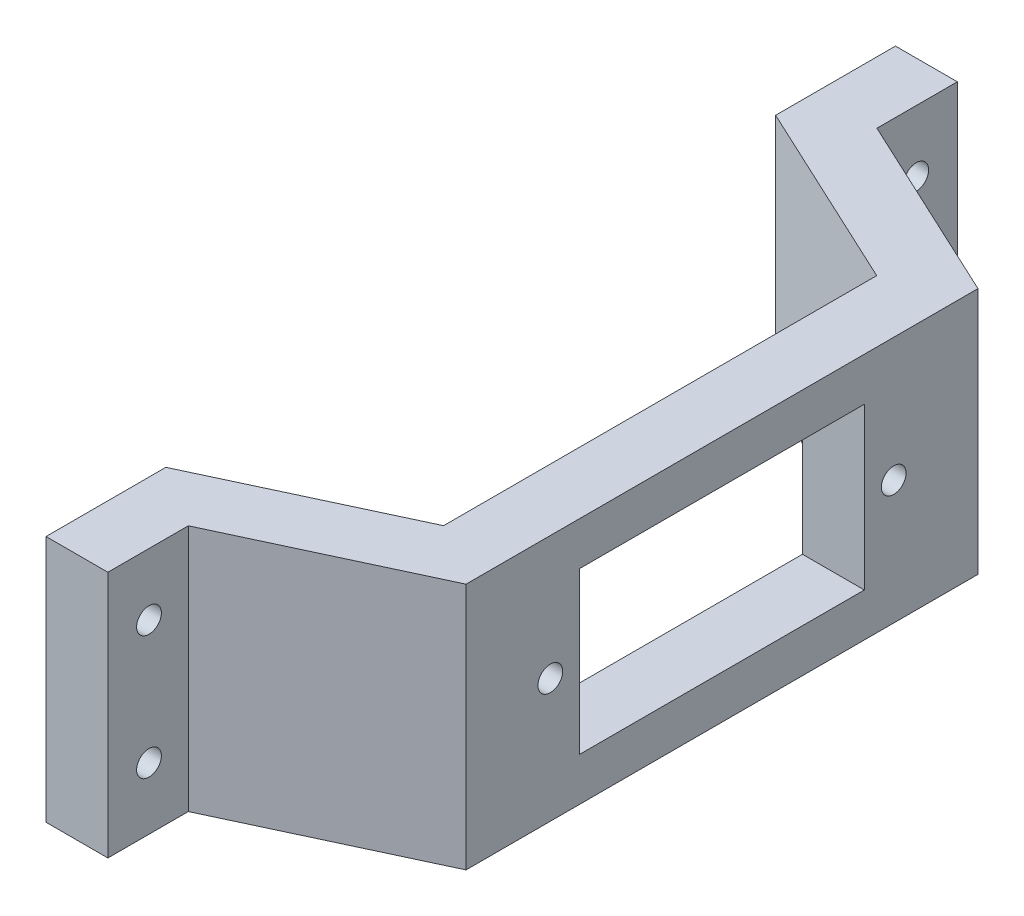
ISO-10303-21;
HEADER;
FILE_DESCRIPTION(('STEP AP214'),'2;1');
FILE_NAME('part.step','',(''),(''),'','','');
FILE_SCHEMA(('AUTOMOTIVE_DESIGN { 1 0 10303 214 1 1 1 1 }'));
ENDSEC;
DATA;
#1=APPLICATION_CONTEXT('core data for automotive mechanical design processes');
#2=APPLICATION_PROTOCOL_DEFINITION('international standard','automotive_design',2000,#1);
#3=PRODUCT_CONTEXT('',#1,'mechanical');
#4=PRODUCT('Part','Part','',(#3));
#5=PRODUCT_RELATED_PRODUCT_CATEGORY('part','',(#4));
#6=PRODUCT_DEFINITION_FORMATION('','',#4);
#7=PRODUCT_DEFINITION_CONTEXT('part definition',#1,'design');
#8=PRODUCT_DEFINITION('design','',#6,#7);
#9=PRODUCT_DEFINITION_SHAPE('','',#8);
#10=(LENGTH_UNIT() NAMED_UNIT(*) SI_UNIT(.MILLI.,.METRE.));
#11=(NAMED_UNIT(*) PLANE_ANGLE_UNIT() SI_UNIT($,.RADIAN.));
#12=(NAMED_UNIT(*) SI_UNIT($,.STERADIAN.) SOLID_ANGLE_UNIT());
#13=UNCERTAINTY_MEASURE_WITH_UNIT(LENGTH_MEASURE(1.E-05),#10,'distance_accuracy_value','');
#14=(GEOMETRIC_REPRESENTATION_CONTEXT(3) GLOBAL_UNCERTAINTY_ASSIGNED_CONTEXT((#13)) GLOBAL_UNIT_ASSIGNED_CONTEXT((#10,
#11,#12)) REPRESENTATION_CONTEXT('',''));
#15=CARTESIAN_POINT('',(0.,0.,0.));
#16=DIRECTION('',(0.,0.,1.));
#17=DIRECTION('',(1.,0.,0.));
#18=AXIS2_PLACEMENT_3D('',#15,#16,#17);
#19=CARTESIAN_POINT('',(5.,-10.,-34.3232158889476));
#20=DIRECTION('',(0.,0.,-1.));
#21=DIRECTION('',(-1.,0.,0.));
#22=AXIS2_PLACEMENT_3D('',#19,#20,#21);
#23=PLANE('',#22);
#24=DIRECTION('',(0.,1.,0.));
#25=VECTOR('',#24,1.);
#26=CARTESIAN_POINT('',(0.,-10.,-34.3232158889476));
#27=LINE('',#26,#25);
#28=CARTESIAN_POINT('',(0.,-10.,-34.3232158889476));
#29=VERTEX_POINT('',#28);
#30=CARTESIAN_POINT('',(0.,10.,-34.3232158889476));
#31=VERTEX_POINT('',#30);
#32=EDGE_CURVE('E42',#29,#31,#27,.T.);
#33=ORIENTED_EDGE('',*,*,#32,.T.);
#34=DIRECTION('',(-1.,0.,0.));
#35=VECTOR('',#34,1.);
#36=CARTESIAN_POINT('',(5.,10.,-34.3232158889476));
#37=LINE('',#36,#35);
#38=CARTESIAN_POINT('',(5.,10.,-34.3232158889476));
#39=VERTEX_POINT('',#38);
#40=EDGE_CURVE('E205',#39,#31,#37,.T.);
#41=ORIENTED_EDGE('',*,*,#40,.F.);
#42=DIRECTION('',(0.,1.,0.));
#43=VECTOR('',#42,1.);
#44=CARTESIAN_POINT('',(5.,-10.,-34.3232158889476));
#45=LINE('',#44,#43);
#46=CARTESIAN_POINT('',(5.,-10.,-34.3232158889476));
#47=VERTEX_POINT('',#46);
#48=EDGE_CURVE('E11',#47,#39,#45,.T.);
#49=ORIENTED_EDGE('',*,*,#48,.F.);
#50=DIRECTION('',(-1.,0.,0.));
#51=VECTOR('',#50,1.);
#52=CARTESIAN_POINT('',(5.,-10.,-34.3232158889476));
#53=LINE('',#52,#51);
#54=EDGE_CURVE('E254',#47,#29,#53,.T.);
#55=ORIENTED_EDGE('',*,*,#54,.T.);
#56=EDGE_LOOP('',(#33,#41,#49,#55));
#57=FACE_BOUND('',#56,.T.);
#58=ADVANCED_FACE('F39',(#57),#23,.T.);
#59=CARTESIAN_POINT('',(5.,-10.,-27.8232158889476));
#60=DIRECTION('',(1.,0.,0.));
#61=DIRECTION('',(0.,0.,-1.));
#62=AXIS2_PLACEMENT_3D('',#59,#60,#61);
#63=PLANE('',#62);
#64=CARTESIAN_POINT('',(5.,5.,-31.));
#65=DIRECTION('',(1.,0.,0.));
#66=DIRECTION('',(0.,0.,1.));
#67=AXIS2_PLACEMENT_3D('',#64,#65,#66);
#68=CIRCLE('',#67,0.999999999999998);
#69=CARTESIAN_POINT('',(5.,5.,-30.));
#70=VERTEX_POINT('',#69);
#71=EDGE_CURVE('E636',#70,#70,#68,.T.);
#72=ORIENTED_EDGE('',*,*,#71,.F.);
#73=EDGE_LOOP('',(#72));
#74=FACE_BOUND('',#73,.T.);
#75=CARTESIAN_POINT('',(5.,-4.99999999999999,-31.));
#76=DIRECTION('',(1.,0.,0.));
#77=DIRECTION('',(0.,0.,-1.));
#78=AXIS2_PLACEMENT_3D('',#75,#76,#77);
#79=CIRCLE('',#78,0.999999999999998);
#80=CARTESIAN_POINT('',(5.,-4.99999999999999,-32.));
#81=VERTEX_POINT('',#80);
#82=EDGE_CURVE('E612',#81,#81,#79,.T.);
#83=ORIENTED_EDGE('',*,*,#82,.F.);
#84=EDGE_LOOP('',(#83));
#85=FACE_BOUND('',#84,.T.);
#86=ORIENTED_EDGE('',*,*,#48,.T.);
#87=DIRECTION('',(0.,0.,-1.));
#88=VECTOR('',#87,1.);
#89=CARTESIAN_POINT('',(5.,10.,-27.8232158889476));
#90=LINE('',#89,#88);
#91=CARTESIAN_POINT('',(5.,10.,-27.8232158889476));
#92=VERTEX_POINT('',#91);
#93=EDGE_CURVE('E250',#92,#39,#90,.T.);
#94=ORIENTED_EDGE('',*,*,#93,.F.);
#95=DIRECTION('',(0.,1.,0.));
#96=VECTOR('',#95,1.);
#97=CARTESIAN_POINT('',(5.,-10.,-27.8232158889476));
#98=LINE('',#97,#96);
#99=CARTESIAN_POINT('',(5.,-10.,-27.8232158889476));
#100=VERTEX_POINT('',#99);
#101=EDGE_CURVE('E48',#100,#92,#98,.T.);
#102=ORIENTED_EDGE('',*,*,#101,.F.);
#103=DIRECTION('',(0.,0.,-1.));
#104=VECTOR('',#103,1.);
#105=CARTESIAN_POINT('',(5.,-10.,-27.8232158889476));
#106=LINE('',#105,#104);
#107=EDGE_CURVE('E298',#100,#47,#106,.T.);
#108=ORIENTED_EDGE('',*,*,#107,.T.);
#109=EDGE_LOOP('',(#86,#94,#102,#108));
#110=FACE_BOUND('',#109,.T.);
#111=ADVANCED_FACE('F343',(#74,#85,#110),#63,.T.);
#112=CARTESIAN_POINT('',(20.3072,-10.,-20.6853513040375));
#113=DIRECTION('',(0.422618261740697,0.,-0.906307787036651));
#114=DIRECTION('',(-0.906307787036651,0.,-0.422618261740697));
#115=AXIS2_PLACEMENT_3D('',#112,#113,#114);
#116=PLANE('',#115);
#117=ORIENTED_EDGE('',*,*,#101,.T.);
#118=DIRECTION('',(-0.906307787036651,0.,-0.422618261740697));
#119=VECTOR('',#118,1.);
#120=CARTESIAN_POINT('',(20.3072,10.,-20.6853513040375));
#121=LINE('',#120,#119);
#122=CARTESIAN_POINT('',(20.3072,10.,-20.6853513040375));
#123=VERTEX_POINT('',#122);
#124=EDGE_CURVE('E246',#123,#92,#121,.T.);
#125=ORIENTED_EDGE('',*,*,#124,.F.);
#126=DIRECTION('',(0.,1.,0.));
#127=VECTOR('',#126,1.);
#128=CARTESIAN_POINT('',(20.3072,-10.,-20.6853513040375));
#129=LINE('',#128,#127);
#130=CARTESIAN_POINT('',(20.3072,-10.,-20.6853513040375));
#131=VERTEX_POINT('',#130);
#132=EDGE_CURVE('E304',#131,#123,#129,.T.);
#133=ORIENTED_EDGE('',*,*,#132,.F.);
#134=DIRECTION('',(-0.906307787036651,0.,-0.422618261740697));
#135=VECTOR('',#134,1.);
#136=CARTESIAN_POINT('',(20.3072,-10.,-20.6853513040375));
#137=LINE('',#136,#135);
#138=EDGE_CURVE('E294',#131,#100,#137,.T.);
#139=ORIENTED_EDGE('',*,*,#138,.T.);
#140=EDGE_LOOP('',(#117,#125,#133,#139));
#141=FACE_BOUND('',#140,.T.);
#142=ADVANCED_FACE('F378',(#141),#116,.T.);
#143=CARTESIAN_POINT('',(20.3072,-10.,20.6853513040375));
#144=DIRECTION('',(1.,0.,0.));
#145=DIRECTION('',(0.,0.,-1.));
#146=AXIS2_PLACEMENT_3D('',#143,#144,#145);
#147=PLANE('',#146);
#148=CARTESIAN_POINT('',(20.3072,0.,-13.875));
#149=DIRECTION('',(-1.,0.,0.));
#150=DIRECTION('',(0.,0.,1.));
#151=AXIS2_PLACEMENT_3D('',#148,#149,#150);
#152=CIRCLE('',#151,1.);
#153=CARTESIAN_POINT('',(20.3072,0.,-12.875));
#154=VERTEX_POINT('',#153);
#155=EDGE_CURVE('E210',#154,#154,#152,.T.);
#156=ORIENTED_EDGE('',*,*,#155,.T.);
#157=EDGE_LOOP('',(#156));
#158=FACE_BOUND('',#157,.T.);
#159=CARTESIAN_POINT('',(20.3072,0.,13.875));
#160=DIRECTION('',(-1.,0.,0.));
#161=DIRECTION('',(0.,0.,1.));
#162=AXIS2_PLACEMENT_3D('',#159,#160,#161);
#163=CIRCLE('',#162,1.);
#164=CARTESIAN_POINT('',(20.3072,0.,14.875));
#165=VERTEX_POINT('',#164);
#166=EDGE_CURVE('E601',#165,#165,#163,.T.);
#167=ORIENTED_EDGE('',*,*,#166,.T.);
#168=EDGE_LOOP('',(#167));
#169=FACE_BOUND('',#168,.T.);
#170=DIRECTION('',(0.,-1.,0.));
#171=VECTOR('',#170,1.);
#172=CARTESIAN_POINT('',(20.3072,6.5,-11.5));
#173=LINE('',#172,#171);
#174=CARTESIAN_POINT('',(20.3072,6.5,-11.5));
#175=VERTEX_POINT('',#174);
#176=CARTESIAN_POINT('',(20.3072,-6.5,-11.5));
#177=VERTEX_POINT('',#176);
#178=EDGE_CURVE('E155',#175,#177,#173,.T.);
#179=ORIENTED_EDGE('',*,*,#178,.T.);
#180=DIRECTION('',(0.,0.,1.));
#181=VECTOR('',#180,1.);
#182=CARTESIAN_POINT('',(20.3072,-6.5,11.5));
#183=LINE('',#182,#181);
#184=CARTESIAN_POINT('',(20.3072,-6.5,11.5));
#185=VERTEX_POINT('',#184);
#186=EDGE_CURVE('E165',#177,#185,#183,.T.);
#187=ORIENTED_EDGE('',*,*,#186,.T.);
#188=DIRECTION('',(0.,1.,0.));
#189=VECTOR('',#188,1.);
#190=CARTESIAN_POINT('',(20.3072,6.5,11.5));
#191=LINE('',#190,#189);
#192=CARTESIAN_POINT('',(20.3072,6.5,11.5));
#193=VERTEX_POINT('',#192);
#194=EDGE_CURVE('E56',#185,#193,#191,.T.);
#195=ORIENTED_EDGE('',*,*,#194,.T.);
#196=DIRECTION('',(0.,0.,-1.));
#197=VECTOR('',#196,1.);
#198=CARTESIAN_POINT('',(20.3072,6.5,11.5));
#199=LINE('',#198,#197);
#200=EDGE_CURVE('E162',#193,#175,#199,.T.);
#201=ORIENTED_EDGE('',*,*,#200,.T.);
#202=EDGE_LOOP('',(#179,#187,#195,#201));
#203=FACE_BOUND('',#202,.T.);
#204=ORIENTED_EDGE('',*,*,#132,.T.);
#205=DIRECTION('',(0.,0.,-1.));
#206=VECTOR('',#205,1.);
#207=CARTESIAN_POINT('',(20.3072,10.,20.6853513040375));
#208=LINE('',#207,#206);
#209=CARTESIAN_POINT('',(20.3072,10.,20.6853513040375));
#210=VERTEX_POINT('',#209);
#211=EDGE_CURVE('E242',#210,#123,#208,.T.);
#212=ORIENTED_EDGE('',*,*,#211,.F.);
#213=DIRECTION('',(0.,1.,0.));
#214=VECTOR('',#213,1.);
#215=CARTESIAN_POINT('',(20.3072,-10.,20.6853513040375));
#216=LINE('',#215,#214);
#217=CARTESIAN_POINT('',(20.3072,-10.,20.6853513040375));
#218=VERTEX_POINT('',#217);
#219=EDGE_CURVE('E307',#218,#210,#216,.T.);
#220=ORIENTED_EDGE('',*,*,#219,.F.);
#221=DIRECTION('',(0.,0.,-1.));
#222=VECTOR('',#221,1.);
#223=CARTESIAN_POINT('',(20.3072,-10.,20.6853513040375));
#224=LINE('',#223,#222);
#225=EDGE_CURVE('E290',#218,#131,#224,.T.);
#226=ORIENTED_EDGE('',*,*,#225,.T.);
#227=EDGE_LOOP('',(#204,#212,#220,#226));
#228=FACE_BOUND('',#227,.T.);
#229=ADVANCED_FACE('F170',(#158,#169,#203,#228),#147,.T.);
#230=CARTESIAN_POINT('',(5.,-10.,27.8232158889476));
#231=DIRECTION('',(0.422618261740697,0.,0.906307787036651));
#232=DIRECTION('',(0.906307787036651,0.,-0.422618261740697));
#233=AXIS2_PLACEMENT_3D('',#230,#231,#232);
#234=PLANE('',#233);
#235=ORIENTED_EDGE('',*,*,#219,.T.);
#236=DIRECTION('',(0.906307787036651,0.,-0.422618261740697));
#237=VECTOR('',#236,1.);
#238=CARTESIAN_POINT('',(5.,10.,27.8232158889476));
#239=LINE('',#238,#237);
#240=CARTESIAN_POINT('',(5.,10.,27.8232158889476));
#241=VERTEX_POINT('',#240);
#242=EDGE_CURVE('E238',#241,#210,#239,.T.);
#243=ORIENTED_EDGE('',*,*,#242,.F.);
#244=DIRECTION('',(0.,1.,0.));
#245=VECTOR('',#244,1.);
#246=CARTESIAN_POINT('',(5.,-10.,27.8232158889476));
#247=LINE('',#246,#245);
#248=CARTESIAN_POINT('',(5.,-10.,27.8232158889476));
#249=VERTEX_POINT('',#248);
#250=EDGE_CURVE('E310',#249,#241,#247,.T.);
#251=ORIENTED_EDGE('',*,*,#250,.F.);
#252=DIRECTION('',(0.906307787036651,0.,-0.422618261740697));
#253=VECTOR('',#252,1.);
#254=CARTESIAN_POINT('',(5.,-10.,27.8232158889476));
#255=LINE('',#254,#253);
#256=EDGE_CURVE('E286',#249,#218,#255,.T.);
#257=ORIENTED_EDGE('',*,*,#256,.T.);
#258=EDGE_LOOP('',(#235,#243,#251,#257));
#259=FACE_BOUND('',#258,.T.);
#260=ADVANCED_FACE('F374',(#259),#234,.T.);
#261=CARTESIAN_POINT('',(5.,-10.,34.3232158889476));
#262=DIRECTION('',(1.,0.,0.));
#263=DIRECTION('',(0.,0.,-1.));
#264=AXIS2_PLACEMENT_3D('',#261,#262,#263);
#265=PLANE('',#264);
#266=CARTESIAN_POINT('',(5.00000000000002,-5.,31.));
#267=DIRECTION('',(1.,0.,0.));
#268=DIRECTION('',(0.,0.,1.));
#269=AXIS2_PLACEMENT_3D('',#266,#267,#268);
#270=CIRCLE('',#269,0.999999999999998);
#271=CARTESIAN_POINT('',(5.00000000000002,-5.,32.));
#272=VERTEX_POINT('',#271);
#273=EDGE_CURVE('E620',#272,#272,#270,.T.);
#274=ORIENTED_EDGE('',*,*,#273,.F.);
#275=EDGE_LOOP('',(#274));
#276=FACE_BOUND('',#275,.T.);
#277=CARTESIAN_POINT('',(5.00000000000002,4.99999999999999,31.));
#278=DIRECTION('',(1.,0.,0.));
#279=DIRECTION('',(0.,0.,-1.));
#280=AXIS2_PLACEMENT_3D('',#277,#278,#279);
#281=CIRCLE('',#280,0.999999999999998);
#282=CARTESIAN_POINT('',(5.00000000000002,4.99999999999999,30.));
#283=VERTEX_POINT('',#282);
#284=EDGE_CURVE('E628',#283,#283,#281,.T.);
#285=ORIENTED_EDGE('',*,*,#284,.F.);
#286=EDGE_LOOP('',(#285));
#287=FACE_BOUND('',#286,.T.);
#288=ORIENTED_EDGE('',*,*,#250,.T.);
#289=DIRECTION('',(0.,0.,-1.));
#290=VECTOR('',#289,1.);
#291=CARTESIAN_POINT('',(5.,10.,34.3232158889476));
#292=LINE('',#291,#290);
#293=CARTESIAN_POINT('',(5.,10.,34.3232158889476));
#294=VERTEX_POINT('',#293);
#295=EDGE_CURVE('E234',#294,#241,#292,.T.);
#296=ORIENTED_EDGE('',*,*,#295,.F.);
#297=DIRECTION('',(0.,1.,0.));
#298=VECTOR('',#297,1.);
#299=CARTESIAN_POINT('',(5.,-10.,34.3232158889476));
#300=LINE('',#299,#298);
#301=CARTESIAN_POINT('',(5.,-10.,34.3232158889476));
#302=VERTEX_POINT('',#301);
#303=EDGE_CURVE('E313',#302,#294,#300,.T.);
#304=ORIENTED_EDGE('',*,*,#303,.F.);
#305=DIRECTION('',(0.,0.,-1.));
#306=VECTOR('',#305,1.);
#307=CARTESIAN_POINT('',(5.,-10.,34.3232158889476));
#308=LINE('',#307,#306);
#309=EDGE_CURVE('E282',#302,#249,#308,.T.);
#310=ORIENTED_EDGE('',*,*,#309,.T.);
#311=EDGE_LOOP('',(#288,#296,#304,#310));
#312=FACE_BOUND('',#311,.T.);
#313=ADVANCED_FACE('F370',(#276,#287,#312),#265,.T.);
#314=CARTESIAN_POINT('',(0.,-10.,34.3232158889476));
#315=DIRECTION('',(0.,0.,1.));
#316=DIRECTION('',(1.,0.,0.));
#317=AXIS2_PLACEMENT_3D('',#314,#315,#316);
#318=PLANE('',#317);
#319=ORIENTED_EDGE('',*,*,#303,.T.);
#320=DIRECTION('',(1.,0.,0.));
#321=VECTOR('',#320,1.);
#322=CARTESIAN_POINT('',(0.,10.,34.3232158889476));
#323=LINE('',#322,#321);
#324=CARTESIAN_POINT('',(0.,10.,34.3232158889476));
#325=VERTEX_POINT('',#324);
#326=EDGE_CURVE('E230',#325,#294,#323,.T.);
#327=ORIENTED_EDGE('',*,*,#326,.F.);
#328=DIRECTION('',(0.,1.,0.));
#329=VECTOR('',#328,1.);
#330=CARTESIAN_POINT('',(0.,-10.,34.3232158889476));
#331=LINE('',#330,#329);
#332=CARTESIAN_POINT('',(0.,-10.,34.3232158889476));
#333=VERTEX_POINT('',#332);
#334=EDGE_CURVE('E316',#333,#325,#331,.T.);
#335=ORIENTED_EDGE('',*,*,#334,.F.);
#336=DIRECTION('',(1.,0.,0.));
#337=VECTOR('',#336,1.);
#338=CARTESIAN_POINT('',(0.,-10.,34.3232158889476));
#339=LINE('',#338,#337);
#340=EDGE_CURVE('E278',#333,#302,#339,.T.);
#341=ORIENTED_EDGE('',*,*,#340,.T.);
#342=EDGE_LOOP('',(#319,#327,#335,#341));
#343=FACE_BOUND('',#342,.T.);
#344=ADVANCED_FACE('F368',(#343),#318,.T.);
#345=CARTESIAN_POINT('',(0.,-10.,24.6378645849102));
#346=DIRECTION('',(-1.,0.,0.));
#347=DIRECTION('',(0.,0.,1.));
#348=AXIS2_PLACEMENT_3D('',#345,#346,#347);
#349=PLANE('',#348);
#350=CARTESIAN_POINT('',(0.,-5.,31.));
#351=DIRECTION('',(1.,0.,0.));
#352=DIRECTION('',(0.,0.,1.));
#353=AXIS2_PLACEMENT_3D('',#350,#351,#352);
#354=CIRCLE('',#353,0.999999999999998);
#355=CARTESIAN_POINT('',(0.,-5.,32.));
#356=VERTEX_POINT('',#355);
#357=EDGE_CURVE('E624',#356,#356,#354,.T.);
#358=ORIENTED_EDGE('',*,*,#357,.T.);
#359=EDGE_LOOP('',(#358));
#360=FACE_BOUND('',#359,.T.);
#361=CARTESIAN_POINT('',(0.,4.99999999999999,31.));
#362=DIRECTION('',(1.,0.,0.));
#363=DIRECTION('',(0.,0.,-1.));
#364=AXIS2_PLACEMENT_3D('',#361,#362,#363);
#365=CIRCLE('',#364,0.999999999999998);
#366=CARTESIAN_POINT('',(0.,4.99999999999999,30.));
#367=VERTEX_POINT('',#366);
#368=EDGE_CURVE('E632',#367,#367,#365,.T.);
#369=ORIENTED_EDGE('',*,*,#368,.T.);
#370=EDGE_LOOP('',(#369));
#371=FACE_BOUND('',#370,.T.);
#372=ORIENTED_EDGE('',*,*,#334,.T.);
#373=DIRECTION('',(0.,0.,1.));
#374=VECTOR('',#373,1.);
#375=CARTESIAN_POINT('',(0.,10.,24.6378645849102));
#376=LINE('',#375,#374);
#377=CARTESIAN_POINT('',(0.,10.,24.6378645849102));
#378=VERTEX_POINT('',#377);
#379=EDGE_CURVE('E226',#378,#325,#376,.T.);
#380=ORIENTED_EDGE('',*,*,#379,.F.);
#381=DIRECTION('',(0.,1.,0.));
#382=VECTOR('',#381,1.);
#383=CARTESIAN_POINT('',(0.,-10.,24.6378645849102));
#384=LINE('',#383,#382);
#385=CARTESIAN_POINT('',(0.,-10.,24.6378645849102));
#386=VERTEX_POINT('',#385);
#387=EDGE_CURVE('E319',#386,#378,#384,.T.);
#388=ORIENTED_EDGE('',*,*,#387,.F.);
#389=DIRECTION('',(0.,0.,1.));
#390=VECTOR('',#389,1.);
#391=CARTESIAN_POINT('',(0.,-10.,24.6378645849102));
#392=LINE('',#391,#390);
#393=EDGE_CURVE('E274',#386,#333,#392,.T.);
#394=ORIENTED_EDGE('',*,*,#393,.T.);
#395=EDGE_LOOP('',(#372,#380,#388,#394));
#396=FACE_BOUND('',#395,.T.);
#397=ADVANCED_FACE('F363',(#360,#371,#396),#349,.T.);
#398=CARTESIAN_POINT('',(15.3072,-10.,17.5));
#399=DIRECTION('',(-0.422618261740697,0.,-0.906307787036651));
#400=DIRECTION('',(-0.906307787036651,0.,0.422618261740697));
#401=AXIS2_PLACEMENT_3D('',#398,#399,#400);
#402=PLANE('',#401);
#403=ORIENTED_EDGE('',*,*,#387,.T.);
#404=DIRECTION('',(-0.906307787036651,0.,0.422618261740697));
#405=VECTOR('',#404,1.);
#406=CARTESIAN_POINT('',(15.3072,10.,17.5));
#407=LINE('',#406,#405);
#408=CARTESIAN_POINT('',(15.3072,10.,17.5));
#409=VERTEX_POINT('',#408);
#410=EDGE_CURVE('E222',#409,#378,#407,.T.);
#411=ORIENTED_EDGE('',*,*,#410,.F.);
#412=DIRECTION('',(0.,1.,0.));
#413=VECTOR('',#412,1.);
#414=CARTESIAN_POINT('',(15.3072,-10.,17.5));
#415=LINE('',#414,#413);
#416=CARTESIAN_POINT('',(15.3072,-10.,17.5));
#417=VERTEX_POINT('',#416);
#418=EDGE_CURVE('E322',#417,#409,#415,.T.);
#419=ORIENTED_EDGE('',*,*,#418,.F.);
#420=DIRECTION('',(-0.906307787036651,0.,0.422618261740697));
#421=VECTOR('',#420,1.);
#422=CARTESIAN_POINT('',(15.3072,-10.,17.5));
#423=LINE('',#422,#421);
#424=EDGE_CURVE('E270',#417,#386,#423,.T.);
#425=ORIENTED_EDGE('',*,*,#424,.T.);
#426=EDGE_LOOP('',(#403,#411,#419,#425));
#427=FACE_BOUND('',#426,.T.);
#428=ADVANCED_FACE('F358',(#427),#402,.T.);
#429=CARTESIAN_POINT('',(15.3072,-10.,-17.5));
#430=DIRECTION('',(-1.,0.,0.));
#431=DIRECTION('',(0.,0.,1.));
#432=AXIS2_PLACEMENT_3D('',#429,#430,#431);
#433=PLANE('',#432);
#434=CARTESIAN_POINT('',(15.3072,0.,-13.875));
#435=DIRECTION('',(-1.,0.,0.));
#436=DIRECTION('',(0.,0.,1.));
#437=AXIS2_PLACEMENT_3D('',#434,#435,#436);
#438=CIRCLE('',#437,1.);
#439=CARTESIAN_POINT('',(15.3072,0.,-12.875));
#440=VERTEX_POINT('',#439);
#441=EDGE_CURVE('E593',#440,#440,#438,.T.);
#442=ORIENTED_EDGE('',*,*,#441,.F.);
#443=EDGE_LOOP('',(#442));
#444=FACE_BOUND('',#443,.T.);
#445=CARTESIAN_POINT('',(15.3072,0.,13.875));
#446=DIRECTION('',(-1.,0.,0.));
#447=DIRECTION('',(0.,0.,1.));
#448=AXIS2_PLACEMENT_3D('',#445,#446,#447);
#449=CIRCLE('',#448,1.);
#450=CARTESIAN_POINT('',(15.3072,0.,14.875));
#451=VERTEX_POINT('',#450);
#452=EDGE_CURVE('E181',#451,#451,#449,.T.);
#453=ORIENTED_EDGE('',*,*,#452,.F.);
#454=EDGE_LOOP('',(#453));
#455=FACE_BOUND('',#454,.T.);
#456=DIRECTION('',(0.,-1.,0.));
#457=VECTOR('',#456,1.);
#458=CARTESIAN_POINT('',(15.3072,6.5,-11.5));
#459=LINE('',#458,#457);
#460=CARTESIAN_POINT('',(15.3072,6.5,-11.5));
#461=VERTEX_POINT('',#460);
#462=CARTESIAN_POINT('',(15.3072,-6.5,-11.5));
#463=VERTEX_POINT('',#462);
#464=EDGE_CURVE('E64',#461,#463,#459,.T.);
#465=ORIENTED_EDGE('',*,*,#464,.F.);
#466=DIRECTION('',(0.,0.,-1.));
#467=VECTOR('',#466,1.);
#468=CARTESIAN_POINT('',(15.3072,6.5,11.5));
#469=LINE('',#468,#467);
#470=CARTESIAN_POINT('',(15.3072,6.5,11.5));
#471=VERTEX_POINT('',#470);
#472=EDGE_CURVE('E174',#471,#461,#469,.T.);
#473=ORIENTED_EDGE('',*,*,#472,.F.);
#474=DIRECTION('',(0.,1.,0.));
#475=VECTOR('',#474,1.);
#476=CARTESIAN_POINT('',(15.3072,6.5,11.5));
#477=LINE('',#476,#475);
#478=CARTESIAN_POINT('',(15.3072,-6.5,11.5));
#479=VERTEX_POINT('',#478);
#480=EDGE_CURVE('E178',#479,#471,#477,.T.);
#481=ORIENTED_EDGE('',*,*,#480,.F.);
#482=DIRECTION('',(0.,0.,1.));
#483=VECTOR('',#482,1.);
#484=CARTESIAN_POINT('',(15.3072,-6.5,11.5));
#485=LINE('',#484,#483);
#486=EDGE_CURVE('E190',#463,#479,#485,.T.);
#487=ORIENTED_EDGE('',*,*,#486,.F.);
#488=EDGE_LOOP('',(#465,#473,#481,#487));
#489=FACE_BOUND('',#488,.T.);
#490=ORIENTED_EDGE('',*,*,#418,.T.);
#491=DIRECTION('',(0.,0.,1.));
#492=VECTOR('',#491,1.);
#493=CARTESIAN_POINT('',(15.3072,10.,-17.5));
#494=LINE('',#493,#492);
#495=CARTESIAN_POINT('',(15.3072,10.,-17.5));
#496=VERTEX_POINT('',#495);
#497=EDGE_CURVE('E218',#496,#409,#494,.T.);
#498=ORIENTED_EDGE('',*,*,#497,.F.);
#499=DIRECTION('',(0.,1.,0.));
#500=VECTOR('',#499,1.);
#501=CARTESIAN_POINT('',(15.3072,-10.,-17.5));
#502=LINE('',#501,#500);
#503=CARTESIAN_POINT('',(15.3072,-10.,-17.5));
#504=VERTEX_POINT('',#503);
#505=EDGE_CURVE('E325',#504,#496,#502,.T.);
#506=ORIENTED_EDGE('',*,*,#505,.F.);
#507=DIRECTION('',(0.,0.,1.));
#508=VECTOR('',#507,1.);
#509=CARTESIAN_POINT('',(15.3072,-10.,-17.5));
#510=LINE('',#509,#508);
#511=EDGE_CURVE('E266',#504,#417,#510,.T.);
#512=ORIENTED_EDGE('',*,*,#511,.T.);
#513=EDGE_LOOP('',(#490,#498,#506,#512));
#514=FACE_BOUND('',#513,.T.);
#515=ADVANCED_FACE('F356',(#444,#455,#489,#514),#433,.T.);
#516=CARTESIAN_POINT('',(0.,-10.,-24.6378645849102));
#517=DIRECTION('',(-0.422618261740697,0.,0.906307787036651));
#518=DIRECTION('',(0.906307787036651,0.,0.422618261740697));
#519=AXIS2_PLACEMENT_3D('',#516,#517,#518);
#520=PLANE('',#519);
#521=ORIENTED_EDGE('',*,*,#505,.T.);
#522=DIRECTION('',(0.906307787036651,0.,0.422618261740697));
#523=VECTOR('',#522,1.);
#524=CARTESIAN_POINT('',(0.,10.,-24.6378645849102));
#525=LINE('',#524,#523);
#526=CARTESIAN_POINT('',(0.,10.,-24.6378645849102));
#527=VERTEX_POINT('',#526);
#528=EDGE_CURVE('E214',#527,#496,#525,.T.);
#529=ORIENTED_EDGE('',*,*,#528,.F.);
#530=DIRECTION('',(0.,1.,0.));
#531=VECTOR('',#530,1.);
#532=CARTESIAN_POINT('',(0.,-10.,-24.6378645849102));
#533=LINE('',#532,#531);
#534=CARTESIAN_POINT('',(0.,-10.,-24.6378645849102));
#535=VERTEX_POINT('',#534);
#536=EDGE_CURVE('E327',#535,#527,#533,.T.);
#537=ORIENTED_EDGE('',*,*,#536,.F.);
#538=DIRECTION('',(0.906307787036651,0.,0.422618261740697));
#539=VECTOR('',#538,1.);
#540=CARTESIAN_POINT('',(0.,-10.,-24.6378645849102));
#541=LINE('',#540,#539);
#542=EDGE_CURVE('E262',#535,#504,#541,.T.);
#543=ORIENTED_EDGE('',*,*,#542,.T.);
#544=EDGE_LOOP('',(#521,#529,#537,#543));
#545=FACE_BOUND('',#544,.T.);
#546=ADVANCED_FACE('F352',(#545),#520,.T.);
#547=CARTESIAN_POINT('',(0.,-10.,-34.3232158889476));
#548=DIRECTION('',(-1.,0.,0.));
#549=DIRECTION('',(0.,0.,1.));
#550=AXIS2_PLACEMENT_3D('',#547,#548,#549);
#551=PLANE('',#550);
#552=CARTESIAN_POINT('',(0.,5.,-31.));
#553=DIRECTION('',(1.,0.,0.));
#554=DIRECTION('',(0.,0.,1.));
#555=AXIS2_PLACEMENT_3D('',#552,#553,#554);
#556=CIRCLE('',#555,0.999999999999998);
#557=CARTESIAN_POINT('',(0.,5.,-30.));
#558=VERTEX_POINT('',#557);
#559=EDGE_CURVE('E616',#558,#558,#556,.T.);
#560=ORIENTED_EDGE('',*,*,#559,.T.);
#561=EDGE_LOOP('',(#560));
#562=FACE_BOUND('',#561,.T.);
#563=CARTESIAN_POINT('',(0.,-4.99999999999999,-31.));
#564=DIRECTION('',(1.,0.,0.));
#565=DIRECTION('',(0.,0.,-1.));
#566=AXIS2_PLACEMENT_3D('',#563,#564,#565);
#567=CIRCLE('',#566,0.999999999999998);
#568=CARTESIAN_POINT('',(0.,-4.99999999999999,-32.));
#569=VERTEX_POINT('',#568);
#570=EDGE_CURVE('E191',#569,#569,#567,.T.);
#571=ORIENTED_EDGE('',*,*,#570,.T.);
#572=EDGE_LOOP('',(#571));
#573=FACE_BOUND('',#572,.T.);
#574=ORIENTED_EDGE('',*,*,#536,.T.);
#575=DIRECTION('',(0.,0.,1.));
#576=VECTOR('',#575,1.);
#577=CARTESIAN_POINT('',(0.,10.,-34.3232158889476));
#578=LINE('',#577,#576);
#579=EDGE_CURVE('E209',#31,#527,#578,.T.);
#580=ORIENTED_EDGE('',*,*,#579,.F.);
#581=ORIENTED_EDGE('',*,*,#32,.F.);
#582=DIRECTION('',(0.,0.,1.));
#583=VECTOR('',#582,1.);
#584=CARTESIAN_POINT('',(0.,-10.,-34.3232158889476));
#585=LINE('',#584,#583);
#586=EDGE_CURVE('E258',#29,#535,#585,.T.);
#587=ORIENTED_EDGE('',*,*,#586,.T.);
#588=EDGE_LOOP('',(#574,#580,#581,#587));
#589=FACE_BOUND('',#588,.T.);
#590=ADVANCED_FACE('F336',(#562,#573,#589),#551,.T.);
#591=CARTESIAN_POINT('',(0.,-10.,0.));
#592=DIRECTION('',(0.,1.,0.));
#593=DIRECTION('',(0.,0.,1.));
#594=AXIS2_PLACEMENT_3D('',#591,#592,#593);
#595=PLANE('',#594);
#596=ORIENTED_EDGE('',*,*,#54,.F.);
#597=ORIENTED_EDGE('',*,*,#107,.F.);
#598=ORIENTED_EDGE('',*,*,#138,.F.);
#599=ORIENTED_EDGE('',*,*,#225,.F.);
#600=ORIENTED_EDGE('',*,*,#256,.F.);
#601=ORIENTED_EDGE('',*,*,#309,.F.);
#602=ORIENTED_EDGE('',*,*,#340,.F.);
#603=ORIENTED_EDGE('',*,*,#393,.F.);
#604=ORIENTED_EDGE('',*,*,#424,.F.);
#605=ORIENTED_EDGE('',*,*,#511,.F.);
#606=ORIENTED_EDGE('',*,*,#542,.F.);
#607=ORIENTED_EDGE('',*,*,#586,.F.);
#608=EDGE_LOOP('',(#596,#597,#598,#599,#600,#601,#602,#603,#604,#605,#606,#607));
#609=FACE_BOUND('',#608,.T.);
#610=ADVANCED_FACE('F346',(#609),#595,.F.);
#611=CARTESIAN_POINT('',(0.,10.,0.));
#612=DIRECTION('',(0.,1.,0.));
#613=DIRECTION('',(0.,0.,1.));
#614=AXIS2_PLACEMENT_3D('',#611,#612,#613);
#615=PLANE('',#614);
#616=ORIENTED_EDGE('',*,*,#40,.T.);
#617=ORIENTED_EDGE('',*,*,#579,.T.);
#618=ORIENTED_EDGE('',*,*,#528,.T.);
#619=ORIENTED_EDGE('',*,*,#497,.T.);
#620=ORIENTED_EDGE('',*,*,#410,.T.);
#621=ORIENTED_EDGE('',*,*,#379,.T.);
#622=ORIENTED_EDGE('',*,*,#326,.T.);
#623=ORIENTED_EDGE('',*,*,#295,.T.);
#624=ORIENTED_EDGE('',*,*,#242,.T.);
#625=ORIENTED_EDGE('',*,*,#211,.T.);
#626=ORIENTED_EDGE('',*,*,#124,.T.);
#627=ORIENTED_EDGE('',*,*,#93,.T.);
#628=EDGE_LOOP('',(#616,#617,#618,#619,#620,#621,#622,#623,#624,#625,#626,#627));
#629=FACE_BOUND('',#628,.T.);
#630=ADVANCED_FACE('F339',(#629),#615,.T.);
#631=CARTESIAN_POINT('',(20.3072,6.5,-11.5));
#632=DIRECTION('',(0.,0.,-1.));
#633=DIRECTION('',(0.,1.,0.));
#634=AXIS2_PLACEMENT_3D('',#631,#632,#633);
#635=PLANE('',#634);
#636=ORIENTED_EDGE('',*,*,#464,.T.);
#637=DIRECTION('',(-1.,0.,0.));
#638=VECTOR('',#637,1.);
#639=CARTESIAN_POINT('',(20.3072,-6.5,-11.5));
#640=LINE('',#639,#638);
#641=EDGE_CURVE('E151',#177,#463,#640,.T.);
#642=ORIENTED_EDGE('',*,*,#641,.F.);
#643=ORIENTED_EDGE('',*,*,#178,.F.);
#644=DIRECTION('',(-1.,0.,0.));
#645=VECTOR('',#644,1.);
#646=CARTESIAN_POINT('',(20.3072,6.5,-11.5));
#647=LINE('',#646,#645);
#648=EDGE_CURVE('E197',#175,#461,#647,.T.);
#649=ORIENTED_EDGE('',*,*,#648,.T.);
#650=EDGE_LOOP('',(#636,#642,#643,#649));
#651=FACE_BOUND('',#650,.T.);
#652=ADVANCED_FACE('F153',(#651),#635,.F.);
#653=CARTESIAN_POINT('',(20.3072,6.5,11.5));
#654=DIRECTION('',(0.,1.,0.));
#655=DIRECTION('',(0.,0.,1.));
#656=AXIS2_PLACEMENT_3D('',#653,#654,#655);
#657=PLANE('',#656);
#658=ORIENTED_EDGE('',*,*,#472,.T.);
#659=ORIENTED_EDGE('',*,*,#648,.F.);
#660=ORIENTED_EDGE('',*,*,#200,.F.);
#661=DIRECTION('',(-1.,0.,0.));
#662=VECTOR('',#661,1.);
#663=CARTESIAN_POINT('',(20.3072,6.5,11.5));
#664=LINE('',#663,#662);
#665=EDGE_CURVE('E200',#193,#471,#664,.T.);
#666=ORIENTED_EDGE('',*,*,#665,.T.);
#667=EDGE_LOOP('',(#658,#659,#660,#666));
#668=FACE_BOUND('',#667,.T.);
#669=ADVANCED_FACE('F492',(#668),#657,.F.);
#670=CARTESIAN_POINT('',(20.3072,6.5,11.5));
#671=DIRECTION('',(0.,0.,1.));
#672=DIRECTION('',(0.,-1.,0.));
#673=AXIS2_PLACEMENT_3D('',#670,#671,#672);
#674=PLANE('',#673);
#675=ORIENTED_EDGE('',*,*,#480,.T.);
#676=ORIENTED_EDGE('',*,*,#665,.F.);
#677=ORIENTED_EDGE('',*,*,#194,.F.);
#678=DIRECTION('',(-1.,0.,0.));
#679=VECTOR('',#678,1.);
#680=CARTESIAN_POINT('',(20.3072,-6.5,11.5));
#681=LINE('',#680,#679);
#682=EDGE_CURVE('E161',#185,#479,#681,.T.);
#683=ORIENTED_EDGE('',*,*,#682,.T.);
#684=EDGE_LOOP('',(#675,#676,#677,#683));
#685=FACE_BOUND('',#684,.T.);
#686=ADVANCED_FACE('F495',(#685),#674,.F.);
#687=CARTESIAN_POINT('',(20.3072,-6.5,11.5));
#688=DIRECTION('',(0.,-1.,0.));
#689=DIRECTION('',(0.,0.,-1.));
#690=AXIS2_PLACEMENT_3D('',#687,#688,#689);
#691=PLANE('',#690);
#692=ORIENTED_EDGE('',*,*,#486,.T.);
#693=ORIENTED_EDGE('',*,*,#682,.F.);
#694=ORIENTED_EDGE('',*,*,#186,.F.);
#695=ORIENTED_EDGE('',*,*,#641,.T.);
#696=EDGE_LOOP('',(#692,#693,#694,#695));
#697=FACE_BOUND('',#696,.T.);
#698=ADVANCED_FACE('F166',(#697),#691,.F.);
#699=CARTESIAN_POINT('',(20.3072,0.,13.875));
#700=DIRECTION('',(-1.,0.,0.));
#701=DIRECTION('',(0.,0.,1.));
#702=AXIS2_PLACEMENT_3D('',#699,#700,#701);
#703=CYLINDRICAL_SURFACE('',#702,1.);
#704=ORIENTED_EDGE('',*,*,#166,.F.);
#705=EDGE_LOOP('',(#704));
#706=FACE_BOUND('',#705,.T.);
#707=ORIENTED_EDGE('',*,*,#452,.T.);
#708=EDGE_LOOP('',(#707));
#709=FACE_BOUND('',#708,.T.);
#710=ADVANCED_FACE('F487',(#706,#709),#703,.F.);
#711=CARTESIAN_POINT('',(20.3072,0.,-13.875));
#712=DIRECTION('',(-1.,0.,0.));
#713=DIRECTION('',(0.,0.,1.));
#714=AXIS2_PLACEMENT_3D('',#711,#712,#713);
#715=CYLINDRICAL_SURFACE('',#714,1.);
#716=ORIENTED_EDGE('',*,*,#155,.F.);
#717=EDGE_LOOP('',(#716));
#718=FACE_BOUND('',#717,.T.);
#719=ORIENTED_EDGE('',*,*,#441,.T.);
#720=EDGE_LOOP('',(#719));
#721=FACE_BOUND('',#720,.T.);
#722=ADVANCED_FACE('F403',(#718,#721),#715,.F.);
#723=CARTESIAN_POINT('',(0.,-4.99999999999999,-31.));
#724=DIRECTION('',(1.,0.,0.));
#725=DIRECTION('',(0.,0.,-1.));
#726=AXIS2_PLACEMENT_3D('',#723,#724,#725);
#727=CYLINDRICAL_SURFACE('',#726,0.999999999999998);
#728=ORIENTED_EDGE('',*,*,#570,.F.);
#729=EDGE_LOOP('',(#728));
#730=FACE_BOUND('',#729,.T.);
#731=ORIENTED_EDGE('',*,*,#82,.T.);
#732=EDGE_LOOP('',(#731));
#733=FACE_BOUND('',#732,.T.);
#734=ADVANCED_FACE('F444',(#730,#733),#727,.F.);
#735=CARTESIAN_POINT('',(0.,5.,-31.));
#736=DIRECTION('',(1.,0.,0.));
#737=DIRECTION('',(0.,0.,-1.));
#738=AXIS2_PLACEMENT_3D('',#735,#736,#737);
#739=CYLINDRICAL_SURFACE('',#738,0.999999999999998);
#740=ORIENTED_EDGE('',*,*,#559,.F.);
#741=EDGE_LOOP('',(#740));
#742=FACE_BOUND('',#741,.T.);
#743=ORIENTED_EDGE('',*,*,#71,.T.);
#744=EDGE_LOOP('',(#743));
#745=FACE_BOUND('',#744,.T.);
#746=ADVANCED_FACE('F449',(#742,#745),#739,.F.);
#747=CARTESIAN_POINT('',(0.,4.99999999999999,31.));
#748=DIRECTION('',(1.,0.,0.));
#749=DIRECTION('',(0.,0.,-1.));
#750=AXIS2_PLACEMENT_3D('',#747,#748,#749);
#751=CYLINDRICAL_SURFACE('',#750,0.999999999999998);
#752=ORIENTED_EDGE('',*,*,#368,.F.);
#753=EDGE_LOOP('',(#752));
#754=FACE_BOUND('',#753,.T.);
#755=ORIENTED_EDGE('',*,*,#284,.T.);
#756=EDGE_LOOP('',(#755));
#757=FACE_BOUND('',#756,.T.);
#758=ADVANCED_FACE('F459',(#754,#757),#751,.F.);
#759=CARTESIAN_POINT('',(0.,-5.,31.));
#760=DIRECTION('',(1.,0.,0.));
#761=DIRECTION('',(0.,0.,-1.));
#762=AXIS2_PLACEMENT_3D('',#759,#760,#761);
#763=CYLINDRICAL_SURFACE('',#762,0.999999999999998);
#764=ORIENTED_EDGE('',*,*,#357,.F.);
#765=EDGE_LOOP('',(#764));
#766=FACE_BOUND('',#765,.T.);
#767=ORIENTED_EDGE('',*,*,#273,.T.);
#768=EDGE_LOOP('',(#767));
#769=FACE_BOUND('',#768,.T.);
#770=ADVANCED_FACE('F469',(#766,#769),#763,.F.);
#771=CLOSED_SHELL('',(#58,#111,#142,#229,#260,#313,#344,#397,#428,#515,#546,#590,#610,#630,#652,
#669,#686,#698,#710,#722,#734,#746,#758,#770));
#772=MANIFOLD_SOLID_BREP('B2',#771);
#773=ADVANCED_BREP_SHAPE_REPRESENTATION('',(#18,#772),#14);
#774=SHAPE_DEFINITION_REPRESENTATION(#9,#773);
ENDSEC;
END-ISO-10303-21;
